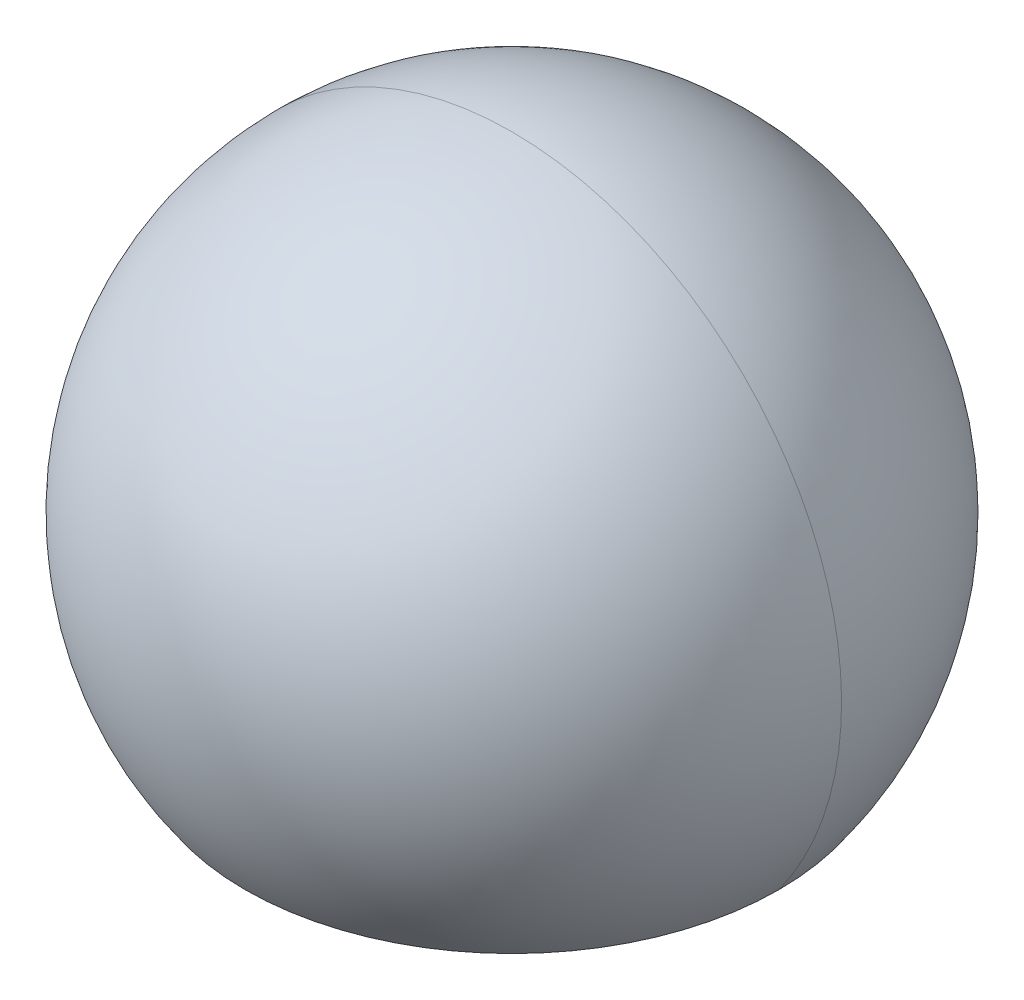
ISO-10303-21;
HEADER;
FILE_DESCRIPTION(('STEP AP214'),'2;1');
FILE_NAME('part.step','',(''),(''),'','','');
FILE_SCHEMA(('AUTOMOTIVE_DESIGN { 1 0 10303 214 1 1 1 1 }'));
ENDSEC;
DATA;
#1=APPLICATION_CONTEXT('core data for automotive mechanical design processes');
#2=APPLICATION_PROTOCOL_DEFINITION('international standard','automotive_design',2000,#1);
#3=PRODUCT_CONTEXT('',#1,'mechanical');
#4=PRODUCT('Part','Part','',(#3));
#5=PRODUCT_RELATED_PRODUCT_CATEGORY('part','',(#4));
#6=PRODUCT_DEFINITION_FORMATION('','',#4);
#7=PRODUCT_DEFINITION_CONTEXT('part definition',#1,'design');
#8=PRODUCT_DEFINITION('design','',#6,#7);
#9=PRODUCT_DEFINITION_SHAPE('','',#8);
#10=(LENGTH_UNIT() NAMED_UNIT(*) SI_UNIT(.MILLI.,.METRE.));
#11=(NAMED_UNIT(*) PLANE_ANGLE_UNIT() SI_UNIT($,.RADIAN.));
#12=(NAMED_UNIT(*) SI_UNIT($,.STERADIAN.) SOLID_ANGLE_UNIT());
#13=UNCERTAINTY_MEASURE_WITH_UNIT(LENGTH_MEASURE(1.E-05),#10,'distance_accuracy_value','');
#14=(GEOMETRIC_REPRESENTATION_CONTEXT(3) GLOBAL_UNCERTAINTY_ASSIGNED_CONTEXT((#13)) GLOBAL_UNIT_ASSIGNED_CONTEXT((#10,
#11,#12)) REPRESENTATION_CONTEXT('',''));
#15=CARTESIAN_POINT('',(0.,0.,0.));
#16=DIRECTION('',(0.,0.,1.));
#17=DIRECTION('',(1.,0.,0.));
#18=AXIS2_PLACEMENT_3D('',#15,#16,#17);
#19=CARTESIAN_POINT('',(0.,0.135,0.));
#20=DIRECTION('',(0.,-1.,0.));
#21=DIRECTION('',(-1.,0.,0.));
#22=AXIS2_PLACEMENT_3D('',#19,#20,#21);
#23=SPHERICAL_SURFACE('',#22,0.23);
#24=CARTESIAN_POINT('',(0.,0.135,0.));
#25=DIRECTION('',(0.,0.,-1.));
#26=DIRECTION('',(-0.809618454327685,-0.586956521739089,0.));
#27=AXIS2_PLACEMENT_3D('',#24,#25,#26);
#28=CIRCLE('',#27,0.23);
#29=CARTESIAN_POINT('',(-0.1862122444954,0.,0.));
#30=VERTEX_POINT('',#29);
#31=CARTESIAN_POINT('',(0.,0.365,0.));
#32=VERTEX_POINT('',#31);
#33=EDGE_CURVE('E11',#30,#32,#28,.T.);
#34=ORIENTED_EDGE('',*,*,#33,.F.);
#35=CARTESIAN_POINT('',(0.,0.,0.));
#36=DIRECTION('',(0.,-1.,0.));
#37=DIRECTION('',(1.,0.,0.));
#38=AXIS2_PLACEMENT_3D('',#35,#36,#37);
#39=CIRCLE('',#38,0.1862122444954);
#40=CARTESIAN_POINT('',(0.1862122444954,0.,0.));
#41=VERTEX_POINT('',#40);
#42=EDGE_CURVE('E24',#41,#30,#39,.T.);
#43=ORIENTED_EDGE('',*,*,#42,.F.);
#44=CARTESIAN_POINT('',(0.,0.135,0.));
#45=DIRECTION('',(0.,0.,1.));
#46=DIRECTION('',(0.809618454327685,-0.586956521739089,0.));
#47=AXIS2_PLACEMENT_3D('',#44,#45,#46);
#48=CIRCLE('',#47,0.23);
#49=EDGE_CURVE('E36',#41,#32,#48,.T.);
#50=ORIENTED_EDGE('',*,*,#49,.T.);
#51=EDGE_LOOP('',(#34,#43,#50));
#52=FACE_BOUND('',#51,.T.);
#53=ADVANCED_FACE('F17',(#52),#23,.T.);
#54=CARTESIAN_POINT('',(0.,0.135,0.));
#55=DIRECTION('',(0.,-1.,0.));
#56=DIRECTION('',(-1.,0.,0.));
#57=AXIS2_PLACEMENT_3D('',#54,#55,#56);
#58=SPHERICAL_SURFACE('',#57,0.23);
#59=CARTESIAN_POINT('',(0.,0.,0.));
#60=DIRECTION('',(0.,1.,0.));
#61=DIRECTION('',(1.,0.,0.));
#62=AXIS2_PLACEMENT_3D('',#59,#60,#61);
#63=CIRCLE('',#62,0.1862122444954);
#64=EDGE_CURVE('E40',#41,#30,#63,.T.);
#65=ORIENTED_EDGE('',*,*,#64,.T.);
#66=ORIENTED_EDGE('',*,*,#33,.T.);
#67=ORIENTED_EDGE('',*,*,#49,.F.);
#68=EDGE_LOOP('',(#65,#66,#67));
#69=FACE_BOUND('',#68,.T.);
#70=ADVANCED_FACE('F39',(#69),#58,.T.);
#71=CARTESIAN_POINT('',(0.,0.,0.));
#72=DIRECTION('',(0.,-1.,0.));
#73=DIRECTION('',(-1.,0.,0.));
#74=AXIS2_PLACEMENT_3D('',#71,#72,#73);
#75=PLANE('',#74);
#76=ORIENTED_EDGE('',*,*,#42,.T.);
#77=ORIENTED_EDGE('',*,*,#64,.F.);
#78=EDGE_LOOP('',(#76,#77));
#79=FACE_BOUND('',#78,.T.);
#80=ADVANCED_FACE('F42',(#79),#75,.T.);
#81=CLOSED_SHELL('',(#53,#70,#80));
#82=MANIFOLD_SOLID_BREP('B1',#81);
#83=ADVANCED_BREP_SHAPE_REPRESENTATION('',(#18,#82),#14);
#84=SHAPE_DEFINITION_REPRESENTATION(#9,#83);
ENDSEC;
END-ISO-10303-21;
